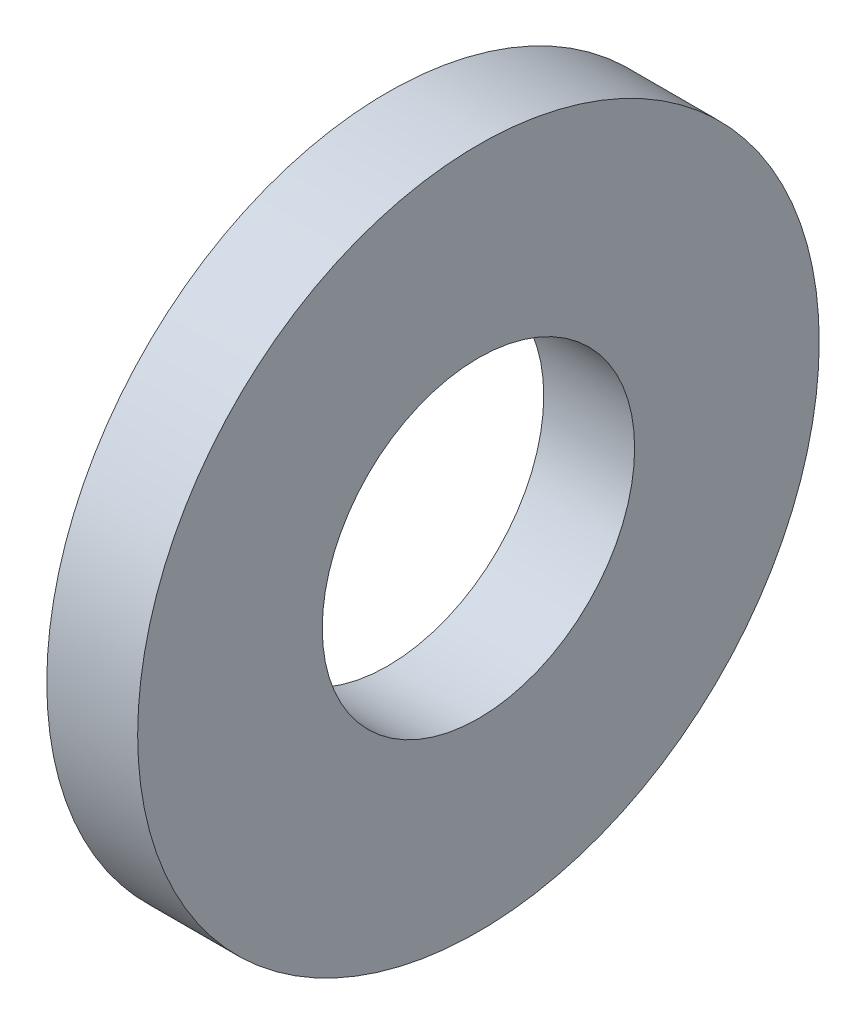
ISO-10303-21;
HEADER;
FILE_DESCRIPTION(('STEP AP214'),'2;1');
FILE_NAME('part.step','',(''),(''),'','','');
FILE_SCHEMA(('AUTOMOTIVE_DESIGN { 1 0 10303 214 1 1 1 1 }'));
ENDSEC;
DATA;
#1=APPLICATION_CONTEXT('core data for automotive mechanical design processes');
#2=APPLICATION_PROTOCOL_DEFINITION('international standard','automotive_design',2000,#1);
#3=PRODUCT_CONTEXT('',#1,'mechanical');
#4=PRODUCT('Part','Part','',(#3));
#5=PRODUCT_RELATED_PRODUCT_CATEGORY('part','',(#4));
#6=PRODUCT_DEFINITION_FORMATION('','',#4);
#7=PRODUCT_DEFINITION_CONTEXT('part definition',#1,'design');
#8=PRODUCT_DEFINITION('design','',#6,#7);
#9=PRODUCT_DEFINITION_SHAPE('','',#8);
#10=(LENGTH_UNIT() NAMED_UNIT(*) SI_UNIT(.MILLI.,.METRE.));
#11=(NAMED_UNIT(*) PLANE_ANGLE_UNIT() SI_UNIT($,.RADIAN.));
#12=(NAMED_UNIT(*) SI_UNIT($,.STERADIAN.) SOLID_ANGLE_UNIT());
#13=UNCERTAINTY_MEASURE_WITH_UNIT(LENGTH_MEASURE(1.E-05),#10,'distance_accuracy_value','');
#14=(GEOMETRIC_REPRESENTATION_CONTEXT(3) GLOBAL_UNCERTAINTY_ASSIGNED_CONTEXT((#13)) GLOBAL_UNIT_ASSIGNED_CONTEXT((#10,
#11,#12)) REPRESENTATION_CONTEXT('',''));
#15=CARTESIAN_POINT('',(0.,0.,0.));
#16=DIRECTION('',(0.,0.,1.));
#17=DIRECTION('',(1.,0.,0.));
#18=AXIS2_PLACEMENT_3D('',#15,#16,#17);
#19=CARTESIAN_POINT('',(1.6,0.,0.));
#20=DIRECTION('',(1.,0.,0.));
#21=DIRECTION('',(0.,0.,-1.));
#22=AXIS2_PLACEMENT_3D('',#19,#20,#21);
#23=PLANE('',#22);
#24=CARTESIAN_POINT('',(1.6,0.,0.));
#25=DIRECTION('',(1.,0.,0.));
#26=DIRECTION('',(0.,0.,-1.));
#27=AXIS2_PLACEMENT_3D('',#24,#25,#26);
#28=CIRCLE('',#27,6.);
#29=CARTESIAN_POINT('',(1.6,0.,-6.));
#30=VERTEX_POINT('',#29);
#31=EDGE_CURVE('E10',#30,#30,#28,.T.);
#32=ORIENTED_EDGE('',*,*,#31,.T.);
#33=EDGE_LOOP('',(#32));
#34=FACE_BOUND('',#33,.T.);
#35=CARTESIAN_POINT('',(1.6,0.,0.));
#36=DIRECTION('',(1.,0.,0.));
#37=DIRECTION('',(0.,0.,-1.));
#38=AXIS2_PLACEMENT_3D('',#35,#36,#37);
#39=CIRCLE('',#38,2.75);
#40=CARTESIAN_POINT('',(1.6,0.,-2.75));
#41=VERTEX_POINT('',#40);
#42=EDGE_CURVE('E42',#41,#41,#39,.T.);
#43=ORIENTED_EDGE('',*,*,#42,.F.);
#44=EDGE_LOOP('',(#43));
#45=FACE_BOUND('',#44,.T.);
#46=ADVANCED_FACE('F31',(#34,#45),#23,.T.);
#47=CARTESIAN_POINT('',(0.,0.,0.));
#48=DIRECTION('',(1.,0.,0.));
#49=DIRECTION('',(0.,0.,-1.));
#50=AXIS2_PLACEMENT_3D('',#47,#48,#49);
#51=PLANE('',#50);
#52=CARTESIAN_POINT('',(0.,0.,0.));
#53=DIRECTION('',(1.,0.,0.));
#54=DIRECTION('',(0.,0.,-1.));
#55=AXIS2_PLACEMENT_3D('',#52,#53,#54);
#56=CIRCLE('',#55,6.);
#57=CARTESIAN_POINT('',(0.,0.,-6.));
#58=VERTEX_POINT('',#57);
#59=EDGE_CURVE('E35',#58,#58,#56,.T.);
#60=ORIENTED_EDGE('',*,*,#59,.F.);
#61=EDGE_LOOP('',(#60));
#62=FACE_BOUND('',#61,.T.);
#63=CARTESIAN_POINT('',(0.,0.,0.));
#64=DIRECTION('',(1.,0.,0.));
#65=DIRECTION('',(0.,0.,-1.));
#66=AXIS2_PLACEMENT_3D('',#63,#64,#65);
#67=CIRCLE('',#66,2.75);
#68=CARTESIAN_POINT('',(0.,0.,-2.75));
#69=VERTEX_POINT('',#68);
#70=EDGE_CURVE('E44',#69,#69,#67,.T.);
#71=ORIENTED_EDGE('',*,*,#70,.T.);
#72=EDGE_LOOP('',(#71));
#73=FACE_BOUND('',#72,.T.);
#74=ADVANCED_FACE('F54',(#62,#73),#51,.F.);
#75=CARTESIAN_POINT('',(1.6,0.,0.));
#76=DIRECTION('',(-1.,0.,0.));
#77=DIRECTION('',(0.,0.,1.));
#78=AXIS2_PLACEMENT_3D('',#75,#76,#77);
#79=CYLINDRICAL_SURFACE('',#78,6.);
#80=ORIENTED_EDGE('',*,*,#31,.F.);
#81=EDGE_LOOP('',(#80));
#82=FACE_BOUND('',#81,.T.);
#83=ORIENTED_EDGE('',*,*,#59,.T.);
#84=EDGE_LOOP('',(#83));
#85=FACE_BOUND('',#84,.T.);
#86=ADVANCED_FACE('F33',(#82,#85),#79,.T.);
#87=CARTESIAN_POINT('',(1.6,0.,0.));
#88=DIRECTION('',(-1.,0.,0.));
#89=DIRECTION('',(0.,0.,1.));
#90=AXIS2_PLACEMENT_3D('',#87,#88,#89);
#91=CYLINDRICAL_SURFACE('',#90,2.75);
#92=ORIENTED_EDGE('',*,*,#42,.T.);
#93=EDGE_LOOP('',(#92));
#94=FACE_BOUND('',#93,.T.);
#95=ORIENTED_EDGE('',*,*,#70,.F.);
#96=EDGE_LOOP('',(#95));
#97=FACE_BOUND('',#96,.T.);
#98=ADVANCED_FACE('F50',(#94,#97),#91,.F.);
#99=CLOSED_SHELL('',(#46,#74,#86,#98));
#100=MANIFOLD_SOLID_BREP('B2',#99);
#101=ADVANCED_BREP_SHAPE_REPRESENTATION('',(#18,#100),#14);
#102=SHAPE_DEFINITION_REPRESENTATION(#9,#101);
ENDSEC;
END-ISO-10303-21;
